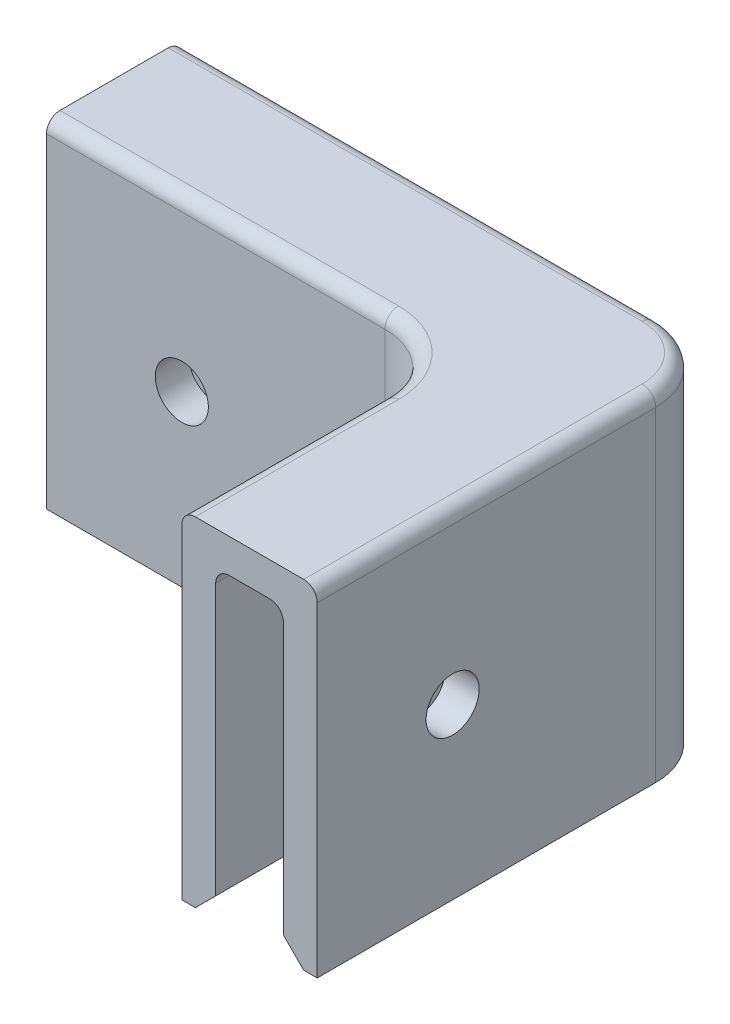
ISO-10303-21;
HEADER;
FILE_DESCRIPTION(('STEP AP214'),'2;1');
FILE_NAME('part.step','',(''),(''),'','','');
FILE_SCHEMA(('AUTOMOTIVE_DESIGN { 1 0 10303 214 1 1 1 1 }'));
ENDSEC;
DATA;
#1=APPLICATION_CONTEXT('core data for automotive mechanical design processes');
#2=APPLICATION_PROTOCOL_DEFINITION('international standard','automotive_design',2000,#1);
#3=PRODUCT_CONTEXT('',#1,'mechanical');
#4=PRODUCT('Part','Part','',(#3));
#5=PRODUCT_RELATED_PRODUCT_CATEGORY('part','',(#4));
#6=PRODUCT_DEFINITION_FORMATION('','',#4);
#7=PRODUCT_DEFINITION_CONTEXT('part definition',#1,'design');
#8=PRODUCT_DEFINITION('design','',#6,#7);
#9=PRODUCT_DEFINITION_SHAPE('','',#8);
#10=(LENGTH_UNIT() NAMED_UNIT(*) SI_UNIT(.MILLI.,.METRE.));
#11=(NAMED_UNIT(*) PLANE_ANGLE_UNIT() SI_UNIT($,.RADIAN.));
#12=(NAMED_UNIT(*) SI_UNIT($,.STERADIAN.) SOLID_ANGLE_UNIT());
#13=UNCERTAINTY_MEASURE_WITH_UNIT(LENGTH_MEASURE(1.E-05),#10,'distance_accuracy_value','');
#14=(GEOMETRIC_REPRESENTATION_CONTEXT(3) GLOBAL_UNCERTAINTY_ASSIGNED_CONTEXT((#13)) GLOBAL_UNIT_ASSIGNED_CONTEXT((#10,
#11,#12)) REPRESENTATION_CONTEXT('',''));
#15=CARTESIAN_POINT('',(0.,0.,0.));
#16=DIRECTION('',(0.,0.,1.));
#17=DIRECTION('',(1.,0.,0.));
#18=AXIS2_PLACEMENT_3D('',#15,#16,#17);
#19=CARTESIAN_POINT('',(0.,0.,0.));
#20=DIRECTION('',(0.,-1.,0.));
#21=DIRECTION('',(0.,0.,-1.));
#22=AXIS2_PLACEMENT_3D('',#19,#20,#21);
#23=PLANE('',#22);
#24=CARTESIAN_POINT('',(-6.35,0.,6.35));
#25=DIRECTION('',(0.,-1.,0.));
#26=DIRECTION('',(0.,0.,-1.));
#27=AXIS2_PLACEMENT_3D('',#24,#25,#26);
#28=CIRCLE('',#27,5.08);
#29=CARTESIAN_POINT('',(-1.27,0.,6.35));
#30=VERTEX_POINT('',#29);
#31=CARTESIAN_POINT('',(-6.35,0.,1.27));
#32=VERTEX_POINT('',#31);
#33=EDGE_CURVE('E327',#30,#32,#28,.F.);
#34=ORIENTED_EDGE('',*,*,#33,.T.);
#35=DIRECTION('',(-1.,0.,0.));
#36=VECTOR('',#35,1.);
#37=CARTESIAN_POINT('',(0.,0.,1.27));
#38=LINE('',#37,#36);
#39=CARTESIAN_POINT('',(-50.8,0.,1.27));
#40=VERTEX_POINT('',#39);
#41=EDGE_CURVE('E264',#32,#40,#38,.T.);
#42=ORIENTED_EDGE('',*,*,#41,.T.);
#43=DIRECTION('',(0.,0.,1.));
#44=VECTOR('',#43,1.);
#45=CARTESIAN_POINT('',(-50.8,0.,12.7));
#46=LINE('',#45,#44);
#47=CARTESIAN_POINT('',(-50.8,0.,0.));
#48=VERTEX_POINT('',#47);
#49=EDGE_CURVE('E244',#48,#40,#46,.T.);
#50=ORIENTED_EDGE('',*,*,#49,.F.);
#51=DIRECTION('',(-1.,0.,0.));
#52=VECTOR('',#51,1.);
#53=CARTESIAN_POINT('',(-50.8,0.,0.));
#54=LINE('',#53,#52);
#55=CARTESIAN_POINT('',(-6.35,0.,0.));
#56=VERTEX_POINT('',#55);
#57=EDGE_CURVE('E253',#56,#48,#54,.T.);
#58=ORIENTED_EDGE('',*,*,#57,.F.);
#59=CARTESIAN_POINT('',(-6.35,0.,6.35));
#60=DIRECTION('',(0.,-1.,0.));
#61=DIRECTION('',(0.,0.,-1.));
#62=AXIS2_PLACEMENT_3D('',#59,#60,#61);
#63=CIRCLE('',#62,6.35);
#64=CARTESIAN_POINT('',(0.,0.,6.35));
#65=VERTEX_POINT('',#64);
#66=EDGE_CURVE('E302',#56,#65,#63,.T.);
#67=ORIENTED_EDGE('',*,*,#66,.T.);
#68=DIRECTION('',(0.,0.,-1.));
#69=VECTOR('',#68,1.);
#70=CARTESIAN_POINT('',(0.,0.,0.));
#71=LINE('',#70,#69);
#72=CARTESIAN_POINT('',(0.,0.,38.1));
#73=VERTEX_POINT('',#72);
#74=EDGE_CURVE('E286',#73,#65,#71,.T.);
#75=ORIENTED_EDGE('',*,*,#74,.F.);
#76=DIRECTION('',(1.,0.,0.));
#77=VECTOR('',#76,1.);
#78=CARTESIAN_POINT('',(0.,0.,38.1));
#79=LINE('',#78,#77);
#80=CARTESIAN_POINT('',(-1.26999999999999,0.,38.1));
#81=VERTEX_POINT('',#80);
#82=EDGE_CURVE('E281',#81,#73,#79,.T.);
#83=ORIENTED_EDGE('',*,*,#82,.F.);
#84=DIRECTION('',(0.,0.,-1.));
#85=VECTOR('',#84,1.);
#86=CARTESIAN_POINT('',(-1.27,0.,0.));
#87=LINE('',#86,#85);
#88=EDGE_CURVE('E318',#81,#30,#87,.T.);
#89=ORIENTED_EDGE('',*,*,#88,.T.);
#90=EDGE_LOOP('',(#34,#42,#50,#58,#67,#75,#83,#89));
#91=FACE_BOUND('',#90,.T.);
#92=ADVANCED_FACE('F49',(#91),#23,.T.);
#93=CARTESIAN_POINT('',(-50.8,0.,11.43));
#94=VERTEX_POINT('',#93);
#95=CARTESIAN_POINT('',(-50.8,0.,12.7));
#96=VERTEX_POINT('',#95);
#97=EDGE_CURVE('E259',#94,#96,#46,.T.);
#98=ORIENTED_EDGE('',*,*,#97,.F.);
#99=DIRECTION('',(1.,0.,0.));
#100=VECTOR('',#99,1.);
#101=CARTESIAN_POINT('',(0.,0.,11.43));
#102=LINE('',#101,#100);
#103=CARTESIAN_POINT('',(-19.05,0.,11.43));
#104=VERTEX_POINT('',#103);
#105=EDGE_CURVE('E362',#94,#104,#102,.T.);
#106=ORIENTED_EDGE('',*,*,#105,.T.);
#107=CARTESIAN_POINT('',(-19.05,0.,19.05));
#108=DIRECTION('',(0.,-1.,0.));
#109=DIRECTION('',(0.,0.,-1.));
#110=AXIS2_PLACEMENT_3D('',#107,#108,#109);
#111=CIRCLE('',#110,7.61999999999999);
#112=CARTESIAN_POINT('',(-11.43,0.,19.05));
#113=VERTEX_POINT('',#112);
#114=EDGE_CURVE('E359',#104,#113,#111,.T.);
#115=ORIENTED_EDGE('',*,*,#114,.T.);
#116=DIRECTION('',(0.,0.,1.));
#117=VECTOR('',#116,1.);
#118=CARTESIAN_POINT('',(-11.43,0.,0.));
#119=LINE('',#118,#117);
#120=CARTESIAN_POINT('',(-11.43,0.,38.1));
#121=VERTEX_POINT('',#120);
#122=EDGE_CURVE('E356',#113,#121,#119,.T.);
#123=ORIENTED_EDGE('',*,*,#122,.T.);
#124=CARTESIAN_POINT('',(-12.7,0.,38.1));
#125=VERTEX_POINT('',#124);
#126=EDGE_CURVE('E282',#125,#121,#79,.T.);
#127=ORIENTED_EDGE('',*,*,#126,.F.);
#128=DIRECTION('',(0.,0.,1.));
#129=VECTOR('',#128,1.);
#130=CARTESIAN_POINT('',(-12.7,0.,38.1));
#131=LINE('',#130,#129);
#132=CARTESIAN_POINT('',(-12.7,0.,19.05));
#133=VERTEX_POINT('',#132);
#134=EDGE_CURVE('E272',#133,#125,#131,.T.);
#135=ORIENTED_EDGE('',*,*,#134,.F.);
#136=CARTESIAN_POINT('',(-19.05,0.,19.05));
#137=DIRECTION('',(0.,-1.,0.));
#138=DIRECTION('',(0.,0.,-1.));
#139=AXIS2_PLACEMENT_3D('',#136,#137,#138);
#140=CIRCLE('',#139,6.35);
#141=CARTESIAN_POINT('',(-19.05,0.,12.7));
#142=VERTEX_POINT('',#141);
#143=EDGE_CURVE('E316',#133,#142,#140,.F.);
#144=ORIENTED_EDGE('',*,*,#143,.T.);
#145=DIRECTION('',(1.,0.,0.));
#146=VECTOR('',#145,1.);
#147=CARTESIAN_POINT('',(-12.7,0.,12.7));
#148=LINE('',#147,#146);
#149=EDGE_CURVE('E266',#96,#142,#148,.T.);
#150=ORIENTED_EDGE('',*,*,#149,.F.);
#151=EDGE_LOOP('',(#98,#106,#115,#123,#127,#135,#144,#150));
#152=FACE_BOUND('',#151,.T.);
#153=ADVANCED_FACE('F600',(#152),#23,.T.);
#154=CARTESIAN_POINT('',(-50.8,31.75,0.));
#155=DIRECTION('',(0.,0.,1.));
#156=DIRECTION('',(1.,0.,0.));
#157=AXIS2_PLACEMENT_3D('',#154,#155,#156);
#158=PLANE('',#157);
#159=CARTESIAN_POINT('',(-38.1,15.875,0.));
#160=DIRECTION('',(0.,0.,1.));
#161=DIRECTION('',(1.,0.,0.));
#162=AXIS2_PLACEMENT_3D('',#159,#160,#161);
#163=CIRCLE('',#162,2.4892);
#164=CARTESIAN_POINT('',(-35.6108,15.875,0.));
#165=VERTEX_POINT('',#164);
#166=EDGE_CURVE('E324',#165,#165,#163,.T.);
#167=ORIENTED_EDGE('',*,*,#166,.T.);
#168=EDGE_LOOP('',(#167));
#169=FACE_BOUND('',#168,.T.);
#170=DIRECTION('',(0.,-1.,0.));
#171=VECTOR('',#170,1.);
#172=CARTESIAN_POINT('',(-50.8,31.75,0.));
#173=LINE('',#172,#171);
#174=CARTESIAN_POINT('',(-50.8,30.48,0.));
#175=VERTEX_POINT('',#174);
#176=EDGE_CURVE('E238',#175,#48,#173,.T.);
#177=ORIENTED_EDGE('',*,*,#176,.F.);
#178=DIRECTION('',(-1.,0.,0.));
#179=VECTOR('',#178,1.);
#180=CARTESIAN_POINT('',(-50.8,30.48,0.));
#181=LINE('',#180,#179);
#182=CARTESIAN_POINT('',(-6.35,30.48,0.));
#183=VERTEX_POINT('',#182);
#184=EDGE_CURVE('E419',#175,#183,#181,.F.);
#185=ORIENTED_EDGE('',*,*,#184,.T.);
#186=DIRECTION('',(0.,-1.,0.));
#187=VECTOR('',#186,1.);
#188=CARTESIAN_POINT('',(-6.35,31.75,0.));
#189=LINE('',#188,#187);
#190=EDGE_CURVE('E249',#183,#56,#189,.T.);
#191=ORIENTED_EDGE('',*,*,#190,.T.);
#192=ORIENTED_EDGE('',*,*,#57,.T.);
#193=EDGE_LOOP('',(#177,#185,#191,#192));
#194=FACE_BOUND('',#193,.T.);
#195=ADVANCED_FACE('F254',(#169,#194),#158,.F.);
#196=CARTESIAN_POINT('',(-50.8,31.75,12.7));
#197=DIRECTION('',(1.,0.,0.));
#198=DIRECTION('',(0.,0.,-1.));
#199=AXIS2_PLACEMENT_3D('',#196,#197,#198);
#200=PLANE('',#199);
#201=DIRECTION('',(0.,0.,1.));
#202=VECTOR('',#201,1.);
#203=CARTESIAN_POINT('',(-50.8,31.75,12.7));
#204=LINE('',#203,#202);
#205=CARTESIAN_POINT('',(-50.8,31.75,1.27));
#206=VERTEX_POINT('',#205);
#207=CARTESIAN_POINT('',(-50.8,31.75,11.43));
#208=VERTEX_POINT('',#207);
#209=EDGE_CURVE('E290',#206,#208,#204,.T.);
#210=ORIENTED_EDGE('',*,*,#209,.F.);
#211=CARTESIAN_POINT('',(-50.8,30.48,1.27));
#212=DIRECTION('',(1.,0.,0.));
#213=DIRECTION('',(0.,0.,-1.));
#214=AXIS2_PLACEMENT_3D('',#211,#212,#213);
#215=CIRCLE('',#214,1.27);
#216=EDGE_CURVE('E245',#206,#175,#215,.F.);
#217=ORIENTED_EDGE('',*,*,#216,.T.);
#218=ORIENTED_EDGE('',*,*,#176,.T.);
#219=ORIENTED_EDGE('',*,*,#49,.T.);
#220=DIRECTION('',(0.,-0.707106781186549,-0.707106781186546));
#221=VECTOR('',#220,1.);
#222=CARTESIAN_POINT('',(-50.8,0.,1.27));
#223=LINE('',#222,#221);
#224=CARTESIAN_POINT('',(-50.8,1.90500000000001,3.175));
#225=VERTEX_POINT('',#224);
#226=EDGE_CURVE('E335',#40,#225,#223,.F.);
#227=ORIENTED_EDGE('',*,*,#226,.T.);
#228=DIRECTION('',(0.,-1.,0.));
#229=VECTOR('',#228,1.);
#230=CARTESIAN_POINT('',(-50.8,31.75,3.175));
#231=LINE('',#230,#229);
#232=CARTESIAN_POINT('',(-50.8,27.305,3.175));
#233=VERTEX_POINT('',#232);
#234=EDGE_CURVE('E550',#233,#225,#231,.T.);
#235=ORIENTED_EDGE('',*,*,#234,.F.);
#236=CARTESIAN_POINT('',(-50.8,27.305,4.445));
#237=DIRECTION('',(1.,0.,0.));
#238=DIRECTION('',(0.,0.,-1.));
#239=AXIS2_PLACEMENT_3D('',#236,#237,#238);
#240=CIRCLE('',#239,1.27);
#241=CARTESIAN_POINT('',(-50.8,28.575,4.445));
#242=VERTEX_POINT('',#241);
#243=EDGE_CURVE('E479',#233,#242,#240,.T.);
#244=ORIENTED_EDGE('',*,*,#243,.T.);
#245=DIRECTION('',(0.,0.,1.));
#246=VECTOR('',#245,1.);
#247=CARTESIAN_POINT('',(-50.8,28.575,0.));
#248=LINE('',#247,#246);
#249=CARTESIAN_POINT('',(-50.8,28.575,8.255));
#250=VERTEX_POINT('',#249);
#251=EDGE_CURVE('E536',#242,#250,#248,.T.);
#252=ORIENTED_EDGE('',*,*,#251,.T.);
#253=CARTESIAN_POINT('',(-50.8,27.305,8.255));
#254=DIRECTION('',(1.,0.,0.));
#255=DIRECTION('',(0.,0.,-1.));
#256=AXIS2_PLACEMENT_3D('',#253,#254,#255);
#257=CIRCLE('',#256,1.27);
#258=CARTESIAN_POINT('',(-50.8,27.305,9.525));
#259=VERTEX_POINT('',#258);
#260=EDGE_CURVE('E482',#250,#259,#257,.T.);
#261=ORIENTED_EDGE('',*,*,#260,.T.);
#262=DIRECTION('',(0.,-1.,0.));
#263=VECTOR('',#262,1.);
#264=CARTESIAN_POINT('',(-50.8,31.75,9.525));
#265=LINE('',#264,#263);
#266=CARTESIAN_POINT('',(-50.8,1.90500000000002,9.525));
#267=VERTEX_POINT('',#266);
#268=EDGE_CURVE('E548',#259,#267,#265,.T.);
#269=ORIENTED_EDGE('',*,*,#268,.T.);
#270=DIRECTION('',(0.,0.707106781186549,-0.707106781186546));
#271=VECTOR('',#270,1.);
#272=CARTESIAN_POINT('',(-50.8,0.,11.43));
#273=LINE('',#272,#271);
#274=EDGE_CURVE('E332',#267,#94,#273,.F.);
#275=ORIENTED_EDGE('',*,*,#274,.T.);
#276=ORIENTED_EDGE('',*,*,#97,.T.);
#277=DIRECTION('',(0.,-1.,0.));
#278=VECTOR('',#277,1.);
#279=CARTESIAN_POINT('',(-50.8,31.75,12.7));
#280=LINE('',#279,#278);
#281=CARTESIAN_POINT('',(-50.8,30.48,12.7));
#282=VERTEX_POINT('',#281);
#283=EDGE_CURVE('E250',#282,#96,#280,.T.);
#284=ORIENTED_EDGE('',*,*,#283,.F.);
#285=CARTESIAN_POINT('',(-50.8,30.48,11.43));
#286=DIRECTION('',(1.,0.,0.));
#287=DIRECTION('',(0.,0.,-1.));
#288=AXIS2_PLACEMENT_3D('',#285,#286,#287);
#289=CIRCLE('',#288,1.27);
#290=EDGE_CURVE('E414',#282,#208,#289,.F.);
#291=ORIENTED_EDGE('',*,*,#290,.T.);
#292=EDGE_LOOP('',(#210,#217,#218,#219,#227,#235,#244,#252,#261,#269,#275,#276,#284,#291));
#293=FACE_BOUND('',#292,.T.);
#294=ADVANCED_FACE('F241',(#293),#200,.F.);
#295=CARTESIAN_POINT('',(-12.7,31.75,12.7));
#296=DIRECTION('',(0.,0.,-1.));
#297=DIRECTION('',(-1.,0.,0.));
#298=AXIS2_PLACEMENT_3D('',#295,#296,#297);
#299=PLANE('',#298);
#300=CARTESIAN_POINT('',(-38.1,15.875,12.7));
#301=DIRECTION('',(0.,0.,1.));
#302=DIRECTION('',(1.,0.,0.));
#303=AXIS2_PLACEMENT_3D('',#300,#301,#302);
#304=CIRCLE('',#303,2.48919999999999);
#305=CARTESIAN_POINT('',(-35.6108,15.875,12.7));
#306=VERTEX_POINT('',#305);
#307=EDGE_CURVE('E387',#306,#306,#304,.T.);
#308=ORIENTED_EDGE('',*,*,#307,.F.);
#309=EDGE_LOOP('',(#308));
#310=FACE_BOUND('',#309,.T.);
#311=DIRECTION('',(0.,-1.,0.));
#312=VECTOR('',#311,1.);
#313=CARTESIAN_POINT('',(-19.05,31.75,12.7));
#314=LINE('',#313,#312);
#315=CARTESIAN_POINT('',(-19.05,30.48,12.7));
#316=VERTEX_POINT('',#315);
#317=EDGE_CURVE('E312',#142,#316,#314,.F.);
#318=ORIENTED_EDGE('',*,*,#317,.T.);
#319=DIRECTION('',(1.,0.,0.));
#320=VECTOR('',#319,1.);
#321=CARTESIAN_POINT('',(-12.7,30.48,12.7));
#322=LINE('',#321,#320);
#323=EDGE_CURVE('E425',#316,#282,#322,.F.);
#324=ORIENTED_EDGE('',*,*,#323,.T.);
#325=ORIENTED_EDGE('',*,*,#283,.T.);
#326=ORIENTED_EDGE('',*,*,#149,.T.);
#327=EDGE_LOOP('',(#318,#324,#325,#326));
#328=FACE_BOUND('',#327,.T.);
#329=ADVANCED_FACE('F596',(#310,#328),#299,.F.);
#330=CARTESIAN_POINT('',(-12.7,31.75,38.1));
#331=DIRECTION('',(1.,0.,0.));
#332=DIRECTION('',(0.,0.,-1.));
#333=AXIS2_PLACEMENT_3D('',#330,#331,#332);
#334=PLANE('',#333);
#335=CARTESIAN_POINT('',(-12.7,15.875,25.4));
#336=DIRECTION('',(-1.,0.,0.));
#337=DIRECTION('',(0.,0.,1.));
#338=AXIS2_PLACEMENT_3D('',#335,#336,#337);
#339=CIRCLE('',#338,2.4892);
#340=CARTESIAN_POINT('',(-12.7,15.875,27.8892));
#341=VERTEX_POINT('',#340);
#342=EDGE_CURVE('E638',#341,#341,#339,.T.);
#343=ORIENTED_EDGE('',*,*,#342,.F.);
#344=EDGE_LOOP('',(#343));
#345=FACE_BOUND('',#344,.T.);
#346=DIRECTION('',(0.,-1.,0.));
#347=VECTOR('',#346,1.);
#348=CARTESIAN_POINT('',(-12.7,31.75,38.1));
#349=LINE('',#348,#347);
#350=CARTESIAN_POINT('',(-12.7,30.48,38.1));
#351=VERTEX_POINT('',#350);
#352=EDGE_CURVE('E294',#351,#125,#349,.T.);
#353=ORIENTED_EDGE('',*,*,#352,.F.);
#354=DIRECTION('',(0.,0.,1.));
#355=VECTOR('',#354,1.);
#356=CARTESIAN_POINT('',(-12.7,30.48,38.1));
#357=LINE('',#356,#355);
#358=CARTESIAN_POINT('',(-12.7,30.48,19.05));
#359=VERTEX_POINT('',#358);
#360=EDGE_CURVE('E471',#351,#359,#357,.F.);
#361=ORIENTED_EDGE('',*,*,#360,.T.);
#362=DIRECTION('',(0.,-1.,0.));
#363=VECTOR('',#362,1.);
#364=CARTESIAN_POINT('',(-12.7,0.,19.05));
#365=LINE('',#364,#363);
#366=EDGE_CURVE('E309',#359,#133,#365,.T.);
#367=ORIENTED_EDGE('',*,*,#366,.T.);
#368=ORIENTED_EDGE('',*,*,#134,.T.);
#369=EDGE_LOOP('',(#353,#361,#367,#368));
#370=FACE_BOUND('',#369,.T.);
#371=ADVANCED_FACE('F605',(#345,#370),#334,.F.);
#372=CARTESIAN_POINT('',(0.,31.75,38.1));
#373=DIRECTION('',(0.,0.,-1.));
#374=DIRECTION('',(-1.,0.,0.));
#375=AXIS2_PLACEMENT_3D('',#372,#373,#374);
#376=PLANE('',#375);
#377=DIRECTION('',(0.,-1.,0.));
#378=VECTOR('',#377,1.);
#379=CARTESIAN_POINT('',(0.,31.75,38.1));
#380=LINE('',#379,#378);
#381=CARTESIAN_POINT('',(0.,30.48,38.1));
#382=VERTEX_POINT('',#381);
#383=EDGE_CURVE('E291',#382,#73,#380,.T.);
#384=ORIENTED_EDGE('',*,*,#383,.F.);
#385=CARTESIAN_POINT('',(-1.27,30.48,38.1));
#386=DIRECTION('',(0.,0.,-1.));
#387=DIRECTION('',(-1.,0.,0.));
#388=AXIS2_PLACEMENT_3D('',#385,#386,#387);
#389=CIRCLE('',#388,1.27);
#390=CARTESIAN_POINT('',(-1.27,31.75,38.1));
#391=VERTEX_POINT('',#390);
#392=EDGE_CURVE('E468',#382,#391,#389,.F.);
#393=ORIENTED_EDGE('',*,*,#392,.T.);
#394=DIRECTION('',(1.,0.,0.));
#395=VECTOR('',#394,1.);
#396=CARTESIAN_POINT('',(0.,31.75,38.1));
#397=LINE('',#396,#395);
#398=CARTESIAN_POINT('',(-11.43,31.75,38.1));
#399=VERTEX_POINT('',#398);
#400=EDGE_CURVE('E295',#399,#391,#397,.T.);
#401=ORIENTED_EDGE('',*,*,#400,.F.);
#402=CARTESIAN_POINT('',(-11.43,30.48,38.1));
#403=DIRECTION('',(0.,0.,-1.));
#404=DIRECTION('',(-1.,0.,0.));
#405=AXIS2_PLACEMENT_3D('',#402,#403,#404);
#406=CIRCLE('',#405,1.27);
#407=EDGE_CURVE('E75',#399,#351,#406,.F.);
#408=ORIENTED_EDGE('',*,*,#407,.T.);
#409=ORIENTED_EDGE('',*,*,#352,.T.);
#410=ORIENTED_EDGE('',*,*,#126,.T.);
#411=DIRECTION('',(-0.707106781186546,-0.707106781186549,0.));
#412=VECTOR('',#411,1.);
#413=CARTESIAN_POINT('',(-11.43,0.,38.1));
#414=LINE('',#413,#412);
#415=CARTESIAN_POINT('',(-9.525,1.90500000000002,38.1));
#416=VERTEX_POINT('',#415);
#417=EDGE_CURVE('E349',#121,#416,#414,.F.);
#418=ORIENTED_EDGE('',*,*,#417,.T.);
#419=DIRECTION('',(0.,-1.,0.));
#420=VECTOR('',#419,1.);
#421=CARTESIAN_POINT('',(-9.525,31.75,38.1));
#422=LINE('',#421,#420);
#423=CARTESIAN_POINT('',(-9.525,27.305,38.1));
#424=VERTEX_POINT('',#423);
#425=EDGE_CURVE('E529',#424,#416,#422,.T.);
#426=ORIENTED_EDGE('',*,*,#425,.F.);
#427=CARTESIAN_POINT('',(-8.255,27.305,38.1));
#428=DIRECTION('',(0.,0.,-1.));
#429=DIRECTION('',(-1.,0.,0.));
#430=AXIS2_PLACEMENT_3D('',#427,#428,#429);
#431=CIRCLE('',#430,1.27);
#432=CARTESIAN_POINT('',(-8.255,28.575,38.1));
#433=VERTEX_POINT('',#432);
#434=EDGE_CURVE('E11',#424,#433,#431,.T.);
#435=ORIENTED_EDGE('',*,*,#434,.T.);
#436=DIRECTION('',(1.,0.,0.));
#437=VECTOR('',#436,1.);
#438=CARTESIAN_POINT('',(0.,28.575,38.1));
#439=LINE('',#438,#437);
#440=CARTESIAN_POINT('',(-4.445,28.575,38.1));
#441=VERTEX_POINT('',#440);
#442=EDGE_CURVE('E527',#433,#441,#439,.T.);
#443=ORIENTED_EDGE('',*,*,#442,.T.);
#444=CARTESIAN_POINT('',(-4.445,27.305,38.1));
#445=DIRECTION('',(0.,0.,-1.));
#446=DIRECTION('',(-1.,0.,0.));
#447=AXIS2_PLACEMENT_3D('',#444,#445,#446);
#448=CIRCLE('',#447,1.27);
#449=CARTESIAN_POINT('',(-3.17499999999999,27.305,38.1));
#450=VERTEX_POINT('',#449);
#451=EDGE_CURVE('E59',#441,#450,#448,.T.);
#452=ORIENTED_EDGE('',*,*,#451,.T.);
#453=DIRECTION('',(0.,-1.,0.));
#454=VECTOR('',#453,1.);
#455=CARTESIAN_POINT('',(-3.17499999999999,31.75,38.1));
#456=LINE('',#455,#454);
#457=CARTESIAN_POINT('',(-3.17499999999999,1.90500000000001,38.1));
#458=VERTEX_POINT('',#457);
#459=EDGE_CURVE('E535',#450,#458,#456,.T.);
#460=ORIENTED_EDGE('',*,*,#459,.T.);
#461=DIRECTION('',(-0.707106781186546,0.707106781186549,0.));
#462=VECTOR('',#461,1.);
#463=CARTESIAN_POINT('',(-1.27,0.,38.1));
#464=LINE('',#463,#462);
#465=EDGE_CURVE('E353',#458,#81,#464,.F.);
#466=ORIENTED_EDGE('',*,*,#465,.T.);
#467=ORIENTED_EDGE('',*,*,#82,.T.);
#468=EDGE_LOOP('',(#384,#393,#401,#408,#409,#410,#418,#426,#435,#443,#452,#460,#466,#467));
#469=FACE_BOUND('',#468,.T.);
#470=ADVANCED_FACE('F526',(#469),#376,.F.);
#471=CARTESIAN_POINT('',(0.,31.75,0.));
#472=DIRECTION('',(-1.,0.,0.));
#473=DIRECTION('',(0.,0.,1.));
#474=AXIS2_PLACEMENT_3D('',#471,#472,#473);
#475=PLANE('',#474);
#476=CARTESIAN_POINT('',(0.,15.875,25.4));
#477=DIRECTION('',(-1.,0.,0.));
#478=DIRECTION('',(0.,0.,1.));
#479=AXIS2_PLACEMENT_3D('',#476,#477,#478);
#480=CIRCLE('',#479,2.4892);
#481=CARTESIAN_POINT('',(0.,15.875,27.8892));
#482=VERTEX_POINT('',#481);
#483=EDGE_CURVE('E634',#482,#482,#480,.T.);
#484=ORIENTED_EDGE('',*,*,#483,.T.);
#485=EDGE_LOOP('',(#484));
#486=FACE_BOUND('',#485,.T.);
#487=DIRECTION('',(0.,-1.,0.));
#488=VECTOR('',#487,1.);
#489=CARTESIAN_POINT('',(0.,31.75,6.35));
#490=LINE('',#489,#488);
#491=CARTESIAN_POINT('',(0.,30.48,6.35));
#492=VERTEX_POINT('',#491);
#493=EDGE_CURVE('E305',#65,#492,#490,.F.);
#494=ORIENTED_EDGE('',*,*,#493,.T.);
#495=DIRECTION('',(0.,0.,-1.));
#496=VECTOR('',#495,1.);
#497=CARTESIAN_POINT('',(0.,30.48,0.));
#498=LINE('',#497,#496);
#499=EDGE_CURVE('E463',#492,#382,#498,.F.);
#500=ORIENTED_EDGE('',*,*,#499,.T.);
#501=ORIENTED_EDGE('',*,*,#383,.T.);
#502=ORIENTED_EDGE('',*,*,#74,.T.);
#503=EDGE_LOOP('',(#494,#500,#501,#502));
#504=FACE_BOUND('',#503,.T.);
#505=ADVANCED_FACE('F669',(#486,#504),#475,.F.);
#506=CARTESIAN_POINT('',(0.,31.75,0.));
#507=DIRECTION('',(0.,-1.,0.));
#508=DIRECTION('',(0.,0.,-1.));
#509=AXIS2_PLACEMENT_3D('',#506,#507,#508);
#510=PLANE('',#509);
#511=CARTESIAN_POINT('',(-6.35,31.75,6.35));
#512=DIRECTION('',(0.,-1.,0.));
#513=DIRECTION('',(0.,0.,-1.));
#514=AXIS2_PLACEMENT_3D('',#511,#512,#513);
#515=CIRCLE('',#514,5.08);
#516=CARTESIAN_POINT('',(-1.27,31.75,6.35));
#517=VERTEX_POINT('',#516);
#518=CARTESIAN_POINT('',(-6.35,31.75,1.27));
#519=VERTEX_POINT('',#518);
#520=EDGE_CURVE('E407',#517,#519,#515,.F.);
#521=ORIENTED_EDGE('',*,*,#520,.T.);
#522=DIRECTION('',(-1.,0.,0.));
#523=VECTOR('',#522,1.);
#524=CARTESIAN_POINT('',(0.,31.75,1.27));
#525=LINE('',#524,#523);
#526=EDGE_CURVE('E410',#519,#206,#525,.T.);
#527=ORIENTED_EDGE('',*,*,#526,.T.);
#528=ORIENTED_EDGE('',*,*,#209,.T.);
#529=DIRECTION('',(1.,0.,0.));
#530=VECTOR('',#529,1.);
#531=CARTESIAN_POINT('',(0.,31.75,11.43));
#532=LINE('',#531,#530);
#533=CARTESIAN_POINT('',(-19.05,31.75,11.43));
#534=VERTEX_POINT('',#533);
#535=EDGE_CURVE('E400',#208,#534,#532,.T.);
#536=ORIENTED_EDGE('',*,*,#535,.T.);
#537=CARTESIAN_POINT('',(-19.05,31.75,19.05));
#538=DIRECTION('',(0.,-1.,0.));
#539=DIRECTION('',(0.,0.,-1.));
#540=AXIS2_PLACEMENT_3D('',#537,#538,#539);
#541=CIRCLE('',#540,7.62);
#542=CARTESIAN_POINT('',(-11.43,31.75,19.05));
#543=VERTEX_POINT('',#542);
#544=EDGE_CURVE('E397',#534,#543,#541,.T.);
#545=ORIENTED_EDGE('',*,*,#544,.T.);
#546=DIRECTION('',(0.,0.,1.));
#547=VECTOR('',#546,1.);
#548=CARTESIAN_POINT('',(-11.43,31.75,0.));
#549=LINE('',#548,#547);
#550=EDGE_CURVE('E377',#543,#399,#549,.T.);
#551=ORIENTED_EDGE('',*,*,#550,.T.);
#552=ORIENTED_EDGE('',*,*,#400,.T.);
#553=DIRECTION('',(0.,0.,-1.));
#554=VECTOR('',#553,1.);
#555=CARTESIAN_POINT('',(-1.27,31.75,0.));
#556=LINE('',#555,#554);
#557=EDGE_CURVE('E404',#391,#517,#556,.T.);
#558=ORIENTED_EDGE('',*,*,#557,.T.);
#559=EDGE_LOOP('',(#521,#527,#528,#536,#545,#551,#552,#558));
#560=FACE_BOUND('',#559,.T.);
#561=ADVANCED_FACE('F561',(#560),#510,.F.);
#562=CARTESIAN_POINT('',(-6.35,31.75,6.35));
#563=DIRECTION('',(0.,-1.,0.));
#564=DIRECTION('',(0.,0.,-1.));
#565=AXIS2_PLACEMENT_3D('',#562,#563,#564);
#566=CYLINDRICAL_SURFACE('',#565,6.35);
#567=ORIENTED_EDGE('',*,*,#190,.F.);
#568=CARTESIAN_POINT('',(-6.35,30.48,6.35));
#569=DIRECTION('',(0.,-1.,0.));
#570=DIRECTION('',(0.,0.,-1.));
#571=AXIS2_PLACEMENT_3D('',#568,#569,#570);
#572=CIRCLE('',#571,6.35);
#573=EDGE_CURVE('E422',#183,#492,#572,.T.);
#574=ORIENTED_EDGE('',*,*,#573,.T.);
#575=ORIENTED_EDGE('',*,*,#493,.F.);
#576=ORIENTED_EDGE('',*,*,#66,.F.);
#577=EDGE_LOOP('',(#567,#574,#575,#576));
#578=FACE_BOUND('',#577,.T.);
#579=ADVANCED_FACE('F684',(#578),#566,.T.);
#580=CARTESIAN_POINT('',(-19.05,31.75,19.05));
#581=DIRECTION('',(0.,1.,0.));
#582=DIRECTION('',(0.,0.,1.));
#583=AXIS2_PLACEMENT_3D('',#580,#581,#582);
#584=CYLINDRICAL_SURFACE('',#583,6.35);
#585=ORIENTED_EDGE('',*,*,#366,.F.);
#586=CARTESIAN_POINT('',(-19.05,30.48,19.05));
#587=DIRECTION('',(0.,-1.,0.));
#588=DIRECTION('',(0.,0.,-1.));
#589=AXIS2_PLACEMENT_3D('',#586,#587,#588);
#590=CIRCLE('',#589,6.35);
#591=EDGE_CURVE('E428',#359,#316,#590,.F.);
#592=ORIENTED_EDGE('',*,*,#591,.T.);
#593=ORIENTED_EDGE('',*,*,#317,.F.);
#594=ORIENTED_EDGE('',*,*,#143,.F.);
#595=EDGE_LOOP('',(#585,#592,#593,#594));
#596=FACE_BOUND('',#595,.T.);
#597=ADVANCED_FACE('F593',(#596),#584,.F.);
#598=CARTESIAN_POINT('',(-50.8,31.75,3.175));
#599=DIRECTION('',(0.,0.,1.));
#600=DIRECTION('',(1.,0.,0.));
#601=AXIS2_PLACEMENT_3D('',#598,#599,#600);
#602=PLANE('',#601);
#603=CARTESIAN_POINT('',(-38.1,15.875,3.175));
#604=DIRECTION('',(0.,0.,1.));
#605=DIRECTION('',(1.,0.,0.));
#606=AXIS2_PLACEMENT_3D('',#603,#604,#605);
#607=CIRCLE('',#606,2.48919999999999);
#608=CARTESIAN_POINT('',(-35.6108,15.875,3.175));
#609=VERTEX_POINT('',#608);
#610=EDGE_CURVE('E319',#609,#609,#607,.T.);
#611=ORIENTED_EDGE('',*,*,#610,.F.);
#612=EDGE_LOOP('',(#611));
#613=FACE_BOUND('',#612,.T.);
#614=DIRECTION('',(0.,1.,0.));
#615=VECTOR('',#614,1.);
#616=CARTESIAN_POINT('',(-6.35,31.75,3.175));
#617=LINE('',#616,#615);
#618=CARTESIAN_POINT('',(-6.35,27.305,3.175));
#619=VERTEX_POINT('',#618);
#620=CARTESIAN_POINT('',(-6.35,1.90500000000001,3.175));
#621=VERTEX_POINT('',#620);
#622=EDGE_CURVE('E554',#619,#621,#617,.F.);
#623=ORIENTED_EDGE('',*,*,#622,.F.);
#624=DIRECTION('',(-1.,0.,0.));
#625=VECTOR('',#624,1.);
#626=CARTESIAN_POINT('',(-50.8,27.305,3.175));
#627=LINE('',#626,#625);
#628=EDGE_CURVE('E431',#619,#233,#627,.T.);
#629=ORIENTED_EDGE('',*,*,#628,.T.);
#630=ORIENTED_EDGE('',*,*,#234,.T.);
#631=DIRECTION('',(1.,0.,0.));
#632=VECTOR('',#631,1.);
#633=CARTESIAN_POINT('',(-50.8,1.90500000000001,3.175));
#634=LINE('',#633,#632);
#635=EDGE_CURVE('E338',#225,#621,#634,.T.);
#636=ORIENTED_EDGE('',*,*,#635,.T.);
#637=EDGE_LOOP('',(#623,#629,#630,#636));
#638=FACE_BOUND('',#637,.T.);
#639=ADVANCED_FACE('F695',(#613,#638),#602,.T.);
#640=CARTESIAN_POINT('',(-12.7,31.75,9.525));
#641=DIRECTION('',(0.,0.,-1.));
#642=DIRECTION('',(-1.,0.,0.));
#643=AXIS2_PLACEMENT_3D('',#640,#641,#642);
#644=PLANE('',#643);
#645=CARTESIAN_POINT('',(-38.1,15.875,9.525));
#646=DIRECTION('',(0.,0.,-1.));
#647=DIRECTION('',(-1.,0.,0.));
#648=AXIS2_PLACEMENT_3D('',#645,#646,#647);
#649=CIRCLE('',#648,2.48919999999999);
#650=CARTESIAN_POINT('',(-40.5892,15.875,9.525));
#651=VERTEX_POINT('',#650);
#652=EDGE_CURVE('E323',#651,#651,#649,.T.);
#653=ORIENTED_EDGE('',*,*,#652,.F.);
#654=EDGE_LOOP('',(#653));
#655=FACE_BOUND('',#654,.T.);
#656=ORIENTED_EDGE('',*,*,#268,.F.);
#657=DIRECTION('',(1.,0.,0.));
#658=VECTOR('',#657,1.);
#659=CARTESIAN_POINT('',(-19.05,27.305,9.525));
#660=LINE('',#659,#658);
#661=CARTESIAN_POINT('',(-19.05,27.305,9.525));
#662=VERTEX_POINT('',#661);
#663=EDGE_CURVE('E456',#259,#662,#660,.T.);
#664=ORIENTED_EDGE('',*,*,#663,.T.);
#665=DIRECTION('',(0.,1.,0.));
#666=VECTOR('',#665,1.);
#667=CARTESIAN_POINT('',(-19.05,31.75,9.525));
#668=LINE('',#667,#666);
#669=CARTESIAN_POINT('',(-19.05,1.90500000000002,9.525));
#670=VERTEX_POINT('',#669);
#671=EDGE_CURVE('E260',#670,#662,#668,.T.);
#672=ORIENTED_EDGE('',*,*,#671,.F.);
#673=DIRECTION('',(-1.,0.,0.));
#674=VECTOR('',#673,1.);
#675=CARTESIAN_POINT('',(-12.7,1.90500000000002,9.525));
#676=LINE('',#675,#674);
#677=EDGE_CURVE('E366',#670,#267,#676,.T.);
#678=ORIENTED_EDGE('',*,*,#677,.T.);
#679=EDGE_LOOP('',(#656,#664,#672,#678));
#680=FACE_BOUND('',#679,.T.);
#681=ADVANCED_FACE('F701',(#655,#680),#644,.T.);
#682=CARTESIAN_POINT('',(-9.525,31.75,38.1));
#683=DIRECTION('',(1.,0.,0.));
#684=DIRECTION('',(0.,0.,-1.));
#685=AXIS2_PLACEMENT_3D('',#682,#683,#684);
#686=PLANE('',#685);
#687=CARTESIAN_POINT('',(-9.525,15.875,25.4));
#688=DIRECTION('',(1.,0.,0.));
#689=DIRECTION('',(0.,0.,-1.));
#690=AXIS2_PLACEMENT_3D('',#687,#688,#689);
#691=CIRCLE('',#690,2.4892);
#692=CARTESIAN_POINT('',(-9.525,15.875,22.9108));
#693=VERTEX_POINT('',#692);
#694=EDGE_CURVE('E543',#693,#693,#691,.T.);
#695=ORIENTED_EDGE('',*,*,#694,.F.);
#696=EDGE_LOOP('',(#695));
#697=FACE_BOUND('',#696,.T.);
#698=DIRECTION('',(0.,1.,0.));
#699=VECTOR('',#698,1.);
#700=CARTESIAN_POINT('',(-9.525,31.75,19.05));
#701=LINE('',#700,#699);
#702=CARTESIAN_POINT('',(-9.525,27.305,19.05));
#703=VERTEX_POINT('',#702);
#704=CARTESIAN_POINT('',(-9.525,1.90500000000002,19.05));
#705=VERTEX_POINT('',#704);
#706=EDGE_CURVE('E614',#703,#705,#701,.F.);
#707=ORIENTED_EDGE('',*,*,#706,.F.);
#708=DIRECTION('',(0.,0.,1.));
#709=VECTOR('',#708,1.);
#710=CARTESIAN_POINT('',(-9.525,27.305,38.1));
#711=LINE('',#710,#709);
#712=EDGE_CURVE('E67',#703,#424,#711,.T.);
#713=ORIENTED_EDGE('',*,*,#712,.T.);
#714=ORIENTED_EDGE('',*,*,#425,.T.);
#715=DIRECTION('',(0.,0.,-1.));
#716=VECTOR('',#715,1.);
#717=CARTESIAN_POINT('',(-9.525,1.90500000000002,38.1));
#718=LINE('',#717,#716);
#719=EDGE_CURVE('E373',#416,#705,#718,.T.);
#720=ORIENTED_EDGE('',*,*,#719,.T.);
#721=EDGE_LOOP('',(#707,#713,#714,#720));
#722=FACE_BOUND('',#721,.T.);
#723=ADVANCED_FACE('F613',(#697,#722),#686,.T.);
#724=CARTESIAN_POINT('',(-3.175,31.75,0.));
#725=DIRECTION('',(-1.,0.,0.));
#726=DIRECTION('',(0.,0.,1.));
#727=AXIS2_PLACEMENT_3D('',#724,#725,#726);
#728=PLANE('',#727);
#729=CARTESIAN_POINT('',(-3.175,15.875,25.4));
#730=DIRECTION('',(-1.,0.,0.));
#731=DIRECTION('',(0.,0.,1.));
#732=AXIS2_PLACEMENT_3D('',#729,#730,#731);
#733=CIRCLE('',#732,2.4892);
#734=CARTESIAN_POINT('',(-3.17499999999999,15.875,27.8892));
#735=VERTEX_POINT('',#734);
#736=EDGE_CURVE('E630',#735,#735,#733,.T.);
#737=ORIENTED_EDGE('',*,*,#736,.F.);
#738=EDGE_LOOP('',(#737));
#739=FACE_BOUND('',#738,.T.);
#740=ORIENTED_EDGE('',*,*,#459,.F.);
#741=DIRECTION('',(0.,0.,-1.));
#742=VECTOR('',#741,1.);
#743=CARTESIAN_POINT('',(-3.175,27.305,6.35));
#744=LINE('',#743,#742);
#745=CARTESIAN_POINT('',(-3.175,27.305,6.35));
#746=VERTEX_POINT('',#745);
#747=EDGE_CURVE('E474',#450,#746,#744,.T.);
#748=ORIENTED_EDGE('',*,*,#747,.T.);
#749=DIRECTION('',(0.,1.,0.));
#750=VECTOR('',#749,1.);
#751=CARTESIAN_POINT('',(-3.175,31.75,6.35));
#752=LINE('',#751,#750);
#753=CARTESIAN_POINT('',(-3.175,1.90500000000001,6.35));
#754=VERTEX_POINT('',#753);
#755=EDGE_CURVE('E617',#754,#746,#752,.T.);
#756=ORIENTED_EDGE('',*,*,#755,.F.);
#757=DIRECTION('',(0.,0.,1.));
#758=VECTOR('',#757,1.);
#759=CARTESIAN_POINT('',(-3.175,1.90500000000001,0.));
#760=LINE('',#759,#758);
#761=EDGE_CURVE('E345',#754,#458,#760,.T.);
#762=ORIENTED_EDGE('',*,*,#761,.T.);
#763=EDGE_LOOP('',(#740,#748,#756,#762));
#764=FACE_BOUND('',#763,.T.);
#765=ADVANCED_FACE('F714',(#739,#764),#728,.T.);
#766=CARTESIAN_POINT('',(0.,28.575,0.));
#767=DIRECTION('',(0.,-1.,0.));
#768=DIRECTION('',(0.,0.,-1.));
#769=AXIS2_PLACEMENT_3D('',#766,#767,#768);
#770=PLANE('',#769);
#771=ORIENTED_EDGE('',*,*,#251,.F.);
#772=DIRECTION('',(-1.,0.,0.));
#773=VECTOR('',#772,1.);
#774=CARTESIAN_POINT('',(-6.35,28.575,4.445));
#775=LINE('',#774,#773);
#776=CARTESIAN_POINT('',(-6.35,28.575,4.445));
#777=VERTEX_POINT('',#776);
#778=EDGE_CURVE('E450',#242,#777,#775,.F.);
#779=ORIENTED_EDGE('',*,*,#778,.T.);
#780=CARTESIAN_POINT('',(-6.35,28.575,6.35));
#781=DIRECTION('',(0.,-1.,0.));
#782=DIRECTION('',(0.,0.,-1.));
#783=AXIS2_PLACEMENT_3D('',#780,#781,#782);
#784=CIRCLE('',#783,1.905);
#785=CARTESIAN_POINT('',(-4.445,28.575,6.35));
#786=VERTEX_POINT('',#785);
#787=EDGE_CURVE('E447',#777,#786,#784,.T.);
#788=ORIENTED_EDGE('',*,*,#787,.T.);
#789=DIRECTION('',(0.,0.,-1.));
#790=VECTOR('',#789,1.);
#791=CARTESIAN_POINT('',(-4.445,28.575,38.1));
#792=LINE('',#791,#790);
#793=EDGE_CURVE('E444',#786,#441,#792,.F.);
#794=ORIENTED_EDGE('',*,*,#793,.T.);
#795=ORIENTED_EDGE('',*,*,#442,.F.);
#796=DIRECTION('',(0.,0.,1.));
#797=VECTOR('',#796,1.);
#798=CARTESIAN_POINT('',(-8.255,28.575,19.05));
#799=LINE('',#798,#797);
#800=CARTESIAN_POINT('',(-8.255,28.575,19.05));
#801=VERTEX_POINT('',#800);
#802=EDGE_CURVE('E435',#433,#801,#799,.F.);
#803=ORIENTED_EDGE('',*,*,#802,.T.);
#804=CARTESIAN_POINT('',(-19.05,28.575,19.05));
#805=DIRECTION('',(0.,-1.,0.));
#806=DIRECTION('',(0.,0.,-1.));
#807=AXIS2_PLACEMENT_3D('',#804,#805,#806);
#808=CIRCLE('',#807,10.795);
#809=CARTESIAN_POINT('',(-19.05,28.575,8.255));
#810=VERTEX_POINT('',#809);
#811=EDGE_CURVE('E438',#801,#810,#808,.F.);
#812=ORIENTED_EDGE('',*,*,#811,.T.);
#813=DIRECTION('',(1.,0.,0.));
#814=VECTOR('',#813,1.);
#815=CARTESIAN_POINT('',(-50.8,28.575,8.255));
#816=LINE('',#815,#814);
#817=EDGE_CURVE('E441',#810,#250,#816,.F.);
#818=ORIENTED_EDGE('',*,*,#817,.T.);
#819=EDGE_LOOP('',(#771,#779,#788,#794,#795,#803,#812,#818));
#820=FACE_BOUND('',#819,.T.);
#821=ADVANCED_FACE('F532',(#820),#770,.T.);
#822=CARTESIAN_POINT('',(-6.35,31.75,6.35));
#823=DIRECTION('',(0.,-1.,0.));
#824=DIRECTION('',(0.,0.,-1.));
#825=AXIS2_PLACEMENT_3D('',#822,#823,#824);
#826=CYLINDRICAL_SURFACE('',#825,3.175);
#827=ORIENTED_EDGE('',*,*,#755,.T.);
#828=CARTESIAN_POINT('',(-6.35,27.305,6.35));
#829=DIRECTION('',(0.,-1.,0.));
#830=DIRECTION('',(0.,0.,-1.));
#831=AXIS2_PLACEMENT_3D('',#828,#829,#830);
#832=CIRCLE('',#831,3.175);
#833=EDGE_CURVE('E453',#746,#619,#832,.F.);
#834=ORIENTED_EDGE('',*,*,#833,.T.);
#835=ORIENTED_EDGE('',*,*,#622,.T.);
#836=CARTESIAN_POINT('',(-6.35,1.90500000000001,6.35));
#837=DIRECTION('',(0.,-1.,0.));
#838=DIRECTION('',(0.,0.,-1.));
#839=AXIS2_PLACEMENT_3D('',#836,#837,#838);
#840=CIRCLE('',#839,3.175);
#841=EDGE_CURVE('E342',#621,#754,#840,.T.);
#842=ORIENTED_EDGE('',*,*,#841,.T.);
#843=EDGE_LOOP('',(#827,#834,#835,#842));
#844=FACE_BOUND('',#843,.T.);
#845=ADVANCED_FACE('F727',(#844),#826,.F.);
#846=CARTESIAN_POINT('',(-19.05,31.75,19.05));
#847=DIRECTION('',(0.,1.,0.));
#848=DIRECTION('',(0.,0.,1.));
#849=AXIS2_PLACEMENT_3D('',#846,#847,#848);
#850=CYLINDRICAL_SURFACE('',#849,9.525);
#851=ORIENTED_EDGE('',*,*,#671,.T.);
#852=CARTESIAN_POINT('',(-19.05,27.305,19.05));
#853=DIRECTION('',(0.,-1.,0.));
#854=DIRECTION('',(0.,0.,-1.));
#855=AXIS2_PLACEMENT_3D('',#852,#853,#854);
#856=CIRCLE('',#855,9.525);
#857=EDGE_CURVE('E460',#662,#703,#856,.T.);
#858=ORIENTED_EDGE('',*,*,#857,.T.);
#859=ORIENTED_EDGE('',*,*,#706,.T.);
#860=CARTESIAN_POINT('',(-19.05,1.90500000000002,19.05));
#861=DIRECTION('',(0.,-1.,0.));
#862=DIRECTION('',(0.,0.,-1.));
#863=AXIS2_PLACEMENT_3D('',#860,#861,#862);
#864=CIRCLE('',#863,9.525);
#865=EDGE_CURVE('E370',#705,#670,#864,.F.);
#866=ORIENTED_EDGE('',*,*,#865,.T.);
#867=EDGE_LOOP('',(#851,#858,#859,#866));
#868=FACE_BOUND('',#867,.T.);
#869=ADVANCED_FACE('F733',(#868),#850,.T.);
#870=CARTESIAN_POINT('',(-12.7,15.875,25.4));
#871=DIRECTION('',(-1.,0.,0.));
#872=DIRECTION('',(0.,0.,1.));
#873=AXIS2_PLACEMENT_3D('',#870,#871,#872);
#874=CYLINDRICAL_SURFACE('',#873,2.4892);
#875=ORIENTED_EDGE('',*,*,#736,.T.);
#876=EDGE_LOOP('',(#875));
#877=FACE_BOUND('',#876,.T.);
#878=ORIENTED_EDGE('',*,*,#483,.F.);
#879=EDGE_LOOP('',(#878));
#880=FACE_BOUND('',#879,.T.);
#881=ADVANCED_FACE('F740',(#877,#880),#874,.F.);
#882=ORIENTED_EDGE('',*,*,#694,.T.);
#883=EDGE_LOOP('',(#882));
#884=FACE_BOUND('',#883,.T.);
#885=ORIENTED_EDGE('',*,*,#342,.T.);
#886=EDGE_LOOP('',(#885));
#887=FACE_BOUND('',#886,.T.);
#888=ADVANCED_FACE('F746',(#884,#887),#874,.F.);
#889=CARTESIAN_POINT('',(-38.1,15.875,12.7));
#890=DIRECTION('',(0.,0.,1.));
#891=DIRECTION('',(1.,0.,0.));
#892=AXIS2_PLACEMENT_3D('',#889,#890,#891);
#893=CYLINDRICAL_SURFACE('',#892,2.48919999999999);
#894=ORIENTED_EDGE('',*,*,#610,.T.);
#895=EDGE_LOOP('',(#894));
#896=FACE_BOUND('',#895,.T.);
#897=ORIENTED_EDGE('',*,*,#166,.F.);
#898=EDGE_LOOP('',(#897));
#899=FACE_BOUND('',#898,.T.);
#900=ADVANCED_FACE('F753',(#896,#899),#893,.F.);
#901=ORIENTED_EDGE('',*,*,#652,.T.);
#902=EDGE_LOOP('',(#901));
#903=FACE_BOUND('',#902,.T.);
#904=ORIENTED_EDGE('',*,*,#307,.T.);
#905=EDGE_LOOP('',(#904));
#906=FACE_BOUND('',#905,.T.);
#907=ADVANCED_FACE('F652',(#903,#906),#893,.F.);
#908=CARTESIAN_POINT('',(-1.27,0.,0.));
#909=DIRECTION('',(0.707106781186549,0.707106781186546,0.));
#910=DIRECTION('',(0.,0.,-1.));
#911=AXIS2_PLACEMENT_3D('',#908,#909,#910);
#912=PLANE('',#911);
#913=ORIENTED_EDGE('',*,*,#465,.F.);
#914=ORIENTED_EDGE('',*,*,#761,.F.);
#915=DIRECTION('',(-0.707106781186546,0.707106781186549,0.));
#916=VECTOR('',#915,1.);
#917=CARTESIAN_POINT('',(-1.27,0.,6.35));
#918=LINE('',#917,#916);
#919=EDGE_CURVE('E382',#30,#754,#918,.T.);
#920=ORIENTED_EDGE('',*,*,#919,.F.);
#921=ORIENTED_EDGE('',*,*,#88,.F.);
#922=EDGE_LOOP('',(#913,#914,#920,#921));
#923=FACE_BOUND('',#922,.T.);
#924=ADVANCED_FACE('F765',(#923),#912,.F.);
#925=CARTESIAN_POINT('',(-6.35,1.90500000000001,6.35));
#926=DIRECTION('',(0.,-1.,0.));
#927=DIRECTION('',(0.,0.,-1.));
#928=AXIS2_PLACEMENT_3D('',#925,#926,#927);
#929=CONICAL_SURFACE('',#928,3.175,0.785398163397447);
#930=ORIENTED_EDGE('',*,*,#919,.T.);
#931=ORIENTED_EDGE('',*,*,#841,.F.);
#932=DIRECTION('',(0.,0.707106781186549,0.707106781186546));
#933=VECTOR('',#932,1.);
#934=CARTESIAN_POINT('',(-6.35,0.,1.27));
#935=LINE('',#934,#933);
#936=EDGE_CURVE('E378',#32,#621,#935,.T.);
#937=ORIENTED_EDGE('',*,*,#936,.F.);
#938=ORIENTED_EDGE('',*,*,#33,.F.);
#939=EDGE_LOOP('',(#930,#931,#937,#938));
#940=FACE_BOUND('',#939,.T.);
#941=ADVANCED_FACE('F771',(#940),#929,.F.);
#942=CARTESIAN_POINT('',(0.,0.,1.27));
#943=DIRECTION('',(0.,0.707106781186546,-0.707106781186549));
#944=DIRECTION('',(-1.,0.,0.));
#945=AXIS2_PLACEMENT_3D('',#942,#943,#944);
#946=PLANE('',#945);
#947=ORIENTED_EDGE('',*,*,#936,.T.);
#948=ORIENTED_EDGE('',*,*,#635,.F.);
#949=ORIENTED_EDGE('',*,*,#226,.F.);
#950=ORIENTED_EDGE('',*,*,#41,.F.);
#951=EDGE_LOOP('',(#947,#948,#949,#950));
#952=FACE_BOUND('',#951,.T.);
#953=ADVANCED_FACE('F779',(#952),#946,.F.);
#954=CARTESIAN_POINT('',(-11.43,0.,0.));
#955=DIRECTION('',(-0.707106781186549,0.707106781186546,0.));
#956=DIRECTION('',(0.,0.,1.));
#957=AXIS2_PLACEMENT_3D('',#954,#955,#956);
#958=PLANE('',#957);
#959=ORIENTED_EDGE('',*,*,#417,.F.);
#960=ORIENTED_EDGE('',*,*,#122,.F.);
#961=DIRECTION('',(-0.707106781186546,-0.707106781186549,0.));
#962=VECTOR('',#961,1.);
#963=CARTESIAN_POINT('',(-9.525,1.90500000000002,19.05));
#964=LINE('',#963,#962);
#965=EDGE_CURVE('E383',#705,#113,#964,.T.);
#966=ORIENTED_EDGE('',*,*,#965,.F.);
#967=ORIENTED_EDGE('',*,*,#719,.F.);
#968=EDGE_LOOP('',(#959,#960,#966,#967));
#969=FACE_BOUND('',#968,.T.);
#970=ADVANCED_FACE('F610',(#969),#958,.F.);
#971=CARTESIAN_POINT('',(-19.05,1.90500000000002,19.05));
#972=DIRECTION('',(0.,1.,0.));
#973=DIRECTION('',(0.,0.,1.));
#974=AXIS2_PLACEMENT_3D('',#971,#972,#973);
#975=CONICAL_SURFACE('',#974,9.525,0.785398163397447);
#976=ORIENTED_EDGE('',*,*,#965,.T.);
#977=ORIENTED_EDGE('',*,*,#114,.F.);
#978=DIRECTION('',(0.,-0.707106781186549,0.707106781186546));
#979=VECTOR('',#978,1.);
#980=CARTESIAN_POINT('',(-19.05,1.90500000000002,9.525));
#981=LINE('',#980,#979);
#982=EDGE_CURVE('E388',#670,#104,#981,.T.);
#983=ORIENTED_EDGE('',*,*,#982,.F.);
#984=ORIENTED_EDGE('',*,*,#865,.F.);
#985=EDGE_LOOP('',(#976,#977,#983,#984));
#986=FACE_BOUND('',#985,.T.);
#987=ADVANCED_FACE('F792',(#986),#975,.T.);
#988=CARTESIAN_POINT('',(0.,0.,11.43));
#989=DIRECTION('',(0.,0.707106781186546,0.707106781186549));
#990=DIRECTION('',(1.,0.,0.));
#991=AXIS2_PLACEMENT_3D('',#988,#989,#990);
#992=PLANE('',#991);
#993=ORIENTED_EDGE('',*,*,#274,.F.);
#994=ORIENTED_EDGE('',*,*,#677,.F.);
#995=ORIENTED_EDGE('',*,*,#982,.T.);
#996=ORIENTED_EDGE('',*,*,#105,.F.);
#997=EDGE_LOOP('',(#993,#994,#995,#996));
#998=FACE_BOUND('',#997,.T.);
#999=ADVANCED_FACE('F798',(#998),#992,.F.);
#1000=CARTESIAN_POINT('',(-1.27,30.48,0.));
#1001=DIRECTION('',(0.,0.,-1.));
#1002=DIRECTION('',(-1.,0.,0.));
#1003=AXIS2_PLACEMENT_3D('',#1000,#1001,#1002);
#1004=CYLINDRICAL_SURFACE('',#1003,1.27);
#1005=ORIENTED_EDGE('',*,*,#392,.F.);
#1006=ORIENTED_EDGE('',*,*,#499,.F.);
#1007=CARTESIAN_POINT('',(-1.27,30.48,6.35));
#1008=DIRECTION('',(0.,0.,-1.));
#1009=DIRECTION('',(-1.,0.,0.));
#1010=AXIS2_PLACEMENT_3D('',#1007,#1008,#1009);
#1011=CIRCLE('',#1010,1.27);
#1012=EDGE_CURVE('E391',#517,#492,#1011,.T.);
#1013=ORIENTED_EDGE('',*,*,#1012,.F.);
#1014=ORIENTED_EDGE('',*,*,#557,.F.);
#1015=EDGE_LOOP('',(#1005,#1006,#1013,#1014));
#1016=FACE_BOUND('',#1015,.T.);
#1017=ADVANCED_FACE('F566',(#1016),#1004,.T.);
#1018=CARTESIAN_POINT('',(-6.35,30.48,6.35));
#1019=DIRECTION('',(0.,-1.,0.));
#1020=DIRECTION('',(0.,0.,-1.));
#1021=AXIS2_PLACEMENT_3D('',#1018,#1019,#1020);
#1022=TOROIDAL_SURFACE('',#1021,5.08,1.27);
#1023=ORIENTED_EDGE('',*,*,#1012,.T.);
#1024=ORIENTED_EDGE('',*,*,#573,.F.);
#1025=CARTESIAN_POINT('',(-6.35,30.48,1.27));
#1026=DIRECTION('',(-1.,0.,0.));
#1027=DIRECTION('',(0.,0.,1.));
#1028=AXIS2_PLACEMENT_3D('',#1025,#1026,#1027);
#1029=CIRCLE('',#1028,1.27);
#1030=EDGE_CURVE('E487',#519,#183,#1029,.T.);
#1031=ORIENTED_EDGE('',*,*,#1030,.F.);
#1032=ORIENTED_EDGE('',*,*,#520,.F.);
#1033=EDGE_LOOP('',(#1023,#1024,#1031,#1032));
#1034=FACE_BOUND('',#1033,.T.);
#1035=ADVANCED_FACE('F572',(#1034),#1022,.T.);
#1036=CARTESIAN_POINT('',(0.,30.48,1.27));
#1037=DIRECTION('',(-1.,0.,0.));
#1038=DIRECTION('',(0.,0.,1.));
#1039=AXIS2_PLACEMENT_3D('',#1036,#1037,#1038);
#1040=CYLINDRICAL_SURFACE('',#1039,1.27);
#1041=ORIENTED_EDGE('',*,*,#1030,.T.);
#1042=ORIENTED_EDGE('',*,*,#184,.F.);
#1043=ORIENTED_EDGE('',*,*,#216,.F.);
#1044=ORIENTED_EDGE('',*,*,#526,.F.);
#1045=EDGE_LOOP('',(#1041,#1042,#1043,#1044));
#1046=FACE_BOUND('',#1045,.T.);
#1047=ADVANCED_FACE('F816',(#1046),#1040,.T.);
#1048=CARTESIAN_POINT('',(-11.43,30.48,0.));
#1049=DIRECTION('',(0.,0.,1.));
#1050=DIRECTION('',(1.,0.,0.));
#1051=AXIS2_PLACEMENT_3D('',#1048,#1049,#1050);
#1052=CYLINDRICAL_SURFACE('',#1051,1.27);
#1053=ORIENTED_EDGE('',*,*,#407,.F.);
#1054=ORIENTED_EDGE('',*,*,#550,.F.);
#1055=CARTESIAN_POINT('',(-11.43,30.48,19.05));
#1056=DIRECTION('',(0.,0.,-1.));
#1057=DIRECTION('',(-1.,0.,0.));
#1058=AXIS2_PLACEMENT_3D('',#1055,#1056,#1057);
#1059=CIRCLE('',#1058,1.27);
#1060=EDGE_CURVE('E491',#359,#543,#1059,.T.);
#1061=ORIENTED_EDGE('',*,*,#1060,.F.);
#1062=ORIENTED_EDGE('',*,*,#360,.F.);
#1063=EDGE_LOOP('',(#1053,#1054,#1061,#1062));
#1064=FACE_BOUND('',#1063,.T.);
#1065=ADVANCED_FACE('F586',(#1064),#1052,.T.);
#1066=CARTESIAN_POINT('',(-19.05,30.48,19.05));
#1067=DIRECTION('',(0.,-1.,0.));
#1068=DIRECTION('',(0.,0.,-1.));
#1069=AXIS2_PLACEMENT_3D('',#1066,#1067,#1068);
#1070=TOROIDAL_SURFACE('',#1069,7.62,1.27);
#1071=ORIENTED_EDGE('',*,*,#1060,.T.);
#1072=ORIENTED_EDGE('',*,*,#544,.F.);
#1073=CARTESIAN_POINT('',(-19.05,30.48,11.43));
#1074=DIRECTION('',(-1.,0.,0.));
#1075=DIRECTION('',(0.,0.,1.));
#1076=AXIS2_PLACEMENT_3D('',#1073,#1074,#1075);
#1077=CIRCLE('',#1076,1.27);
#1078=EDGE_CURVE('E495',#316,#534,#1077,.T.);
#1079=ORIENTED_EDGE('',*,*,#1078,.F.);
#1080=ORIENTED_EDGE('',*,*,#591,.F.);
#1081=EDGE_LOOP('',(#1071,#1072,#1079,#1080));
#1082=FACE_BOUND('',#1081,.T.);
#1083=ADVANCED_FACE('F589',(#1082),#1070,.T.);
#1084=CARTESIAN_POINT('',(0.,30.48,11.43));
#1085=DIRECTION('',(1.,0.,0.));
#1086=DIRECTION('',(0.,0.,-1.));
#1087=AXIS2_PLACEMENT_3D('',#1084,#1085,#1086);
#1088=CYLINDRICAL_SURFACE('',#1087,1.27);
#1089=ORIENTED_EDGE('',*,*,#290,.F.);
#1090=ORIENTED_EDGE('',*,*,#323,.F.);
#1091=ORIENTED_EDGE('',*,*,#1078,.T.);
#1092=ORIENTED_EDGE('',*,*,#535,.F.);
#1093=EDGE_LOOP('',(#1089,#1090,#1091,#1092));
#1094=FACE_BOUND('',#1093,.T.);
#1095=ADVANCED_FACE('F580',(#1094),#1088,.T.);
#1096=CARTESIAN_POINT('',(-4.445,27.305,0.));
#1097=DIRECTION('',(0.,0.,1.));
#1098=DIRECTION('',(1.,0.,0.));
#1099=AXIS2_PLACEMENT_3D('',#1096,#1097,#1098);
#1100=CYLINDRICAL_SURFACE('',#1099,1.27);
#1101=ORIENTED_EDGE('',*,*,#451,.F.);
#1102=ORIENTED_EDGE('',*,*,#793,.F.);
#1103=CARTESIAN_POINT('',(-4.445,27.305,6.35));
#1104=DIRECTION('',(0.,0.,1.));
#1105=DIRECTION('',(0.,-1.,0.));
#1106=AXIS2_PLACEMENT_3D('',#1103,#1104,#1105);
#1107=CIRCLE('',#1106,1.27);
#1108=EDGE_CURVE('E498',#746,#786,#1107,.T.);
#1109=ORIENTED_EDGE('',*,*,#1108,.F.);
#1110=ORIENTED_EDGE('',*,*,#747,.F.);
#1111=EDGE_LOOP('',(#1101,#1102,#1109,#1110));
#1112=FACE_BOUND('',#1111,.T.);
#1113=ADVANCED_FACE('F837',(#1112),#1100,.F.);
#1114=CARTESIAN_POINT('',(-6.35,27.305,6.35));
#1115=DIRECTION('',(0.,-1.,0.));
#1116=DIRECTION('',(0.,0.,-1.));
#1117=AXIS2_PLACEMENT_3D('',#1114,#1115,#1116);
#1118=TOROIDAL_SURFACE('',#1117,1.905,1.27);
#1119=ORIENTED_EDGE('',*,*,#1108,.T.);
#1120=ORIENTED_EDGE('',*,*,#787,.F.);
#1121=CARTESIAN_POINT('',(-6.35,27.305,4.445));
#1122=DIRECTION('',(1.,0.,0.));
#1123=DIRECTION('',(0.,0.,-1.));
#1124=AXIS2_PLACEMENT_3D('',#1121,#1122,#1123);
#1125=CIRCLE('',#1124,1.27);
#1126=EDGE_CURVE('E502',#619,#777,#1125,.T.);
#1127=ORIENTED_EDGE('',*,*,#1126,.F.);
#1128=ORIENTED_EDGE('',*,*,#833,.F.);
#1129=EDGE_LOOP('',(#1119,#1120,#1127,#1128));
#1130=FACE_BOUND('',#1129,.T.);
#1131=ADVANCED_FACE('F843',(#1130),#1118,.F.);
#1132=CARTESIAN_POINT('',(-50.8,27.305,4.445));
#1133=DIRECTION('',(1.,0.,0.));
#1134=DIRECTION('',(0.,0.,-1.));
#1135=AXIS2_PLACEMENT_3D('',#1132,#1133,#1134);
#1136=CYLINDRICAL_SURFACE('',#1135,1.27);
#1137=ORIENTED_EDGE('',*,*,#1126,.T.);
#1138=ORIENTED_EDGE('',*,*,#778,.F.);
#1139=ORIENTED_EDGE('',*,*,#243,.F.);
#1140=ORIENTED_EDGE('',*,*,#628,.F.);
#1141=EDGE_LOOP('',(#1137,#1138,#1139,#1140));
#1142=FACE_BOUND('',#1141,.T.);
#1143=ADVANCED_FACE('F850',(#1142),#1136,.F.);
#1144=CARTESIAN_POINT('',(-8.255,27.305,38.1));
#1145=DIRECTION('',(0.,0.,-1.));
#1146=DIRECTION('',(-1.,0.,0.));
#1147=AXIS2_PLACEMENT_3D('',#1144,#1145,#1146);
#1148=CYLINDRICAL_SURFACE('',#1147,1.27);
#1149=ORIENTED_EDGE('',*,*,#434,.F.);
#1150=ORIENTED_EDGE('',*,*,#712,.F.);
#1151=CARTESIAN_POINT('',(-8.255,27.305,19.05));
#1152=DIRECTION('',(0.,0.,1.));
#1153=DIRECTION('',(1.,0.,0.));
#1154=AXIS2_PLACEMENT_3D('',#1151,#1152,#1153);
#1155=CIRCLE('',#1154,1.27);
#1156=EDGE_CURVE('E53',#801,#703,#1155,.T.);
#1157=ORIENTED_EDGE('',*,*,#1156,.F.);
#1158=ORIENTED_EDGE('',*,*,#802,.F.);
#1159=EDGE_LOOP('',(#1149,#1150,#1157,#1158));
#1160=FACE_BOUND('',#1159,.T.);
#1161=ADVANCED_FACE('F51',(#1160),#1148,.F.);
#1162=CARTESIAN_POINT('',(-19.05,27.305,19.05));
#1163=DIRECTION('',(0.,-1.,0.));
#1164=DIRECTION('',(0.,0.,-1.));
#1165=AXIS2_PLACEMENT_3D('',#1162,#1163,#1164);
#1166=TOROIDAL_SURFACE('',#1165,10.795,1.27);
#1167=ORIENTED_EDGE('',*,*,#1156,.T.);
#1168=ORIENTED_EDGE('',*,*,#857,.F.);
#1169=CARTESIAN_POINT('',(-19.05,27.305,8.255));
#1170=DIRECTION('',(1.,0.,0.));
#1171=DIRECTION('',(0.,0.,-1.));
#1172=AXIS2_PLACEMENT_3D('',#1169,#1170,#1171);
#1173=CIRCLE('',#1172,1.27);
#1174=EDGE_CURVE('E508',#810,#662,#1173,.T.);
#1175=ORIENTED_EDGE('',*,*,#1174,.F.);
#1176=ORIENTED_EDGE('',*,*,#811,.F.);
#1177=EDGE_LOOP('',(#1167,#1168,#1175,#1176));
#1178=FACE_BOUND('',#1177,.T.);
#1179=ADVANCED_FACE('F519',(#1178),#1166,.F.);
#1180=CARTESIAN_POINT('',(-12.7,27.305,8.255));
#1181=DIRECTION('',(-1.,0.,0.));
#1182=DIRECTION('',(0.,0.,1.));
#1183=AXIS2_PLACEMENT_3D('',#1180,#1181,#1182);
#1184=CYLINDRICAL_SURFACE('',#1183,1.27);
#1185=ORIENTED_EDGE('',*,*,#260,.F.);
#1186=ORIENTED_EDGE('',*,*,#817,.F.);
#1187=ORIENTED_EDGE('',*,*,#1174,.T.);
#1188=ORIENTED_EDGE('',*,*,#663,.F.);
#1189=EDGE_LOOP('',(#1185,#1186,#1187,#1188));
#1190=FACE_BOUND('',#1189,.T.);
#1191=ADVANCED_FACE('F867',(#1190),#1184,.F.);
#1192=CLOSED_SHELL('',(#92,#153,#195,#294,#329,#371,#470,#505,#561,#579,#597,#639,#681,#723,
#765,#821,#845,#869,#881,#888,#900,#907,#924,#941,#953,#970,#987,#999,#1017,#1035,#1047,#1065,
#1083,#1095,#1113,#1131,#1143,#1161,#1179,#1191));
#1193=MANIFOLD_SOLID_BREP('B2',#1192);
#1194=ADVANCED_BREP_SHAPE_REPRESENTATION('',(#18,#1193),#14);
#1195=SHAPE_DEFINITION_REPRESENTATION(#9,#1194);
ENDSEC;
END-ISO-10303-21;
